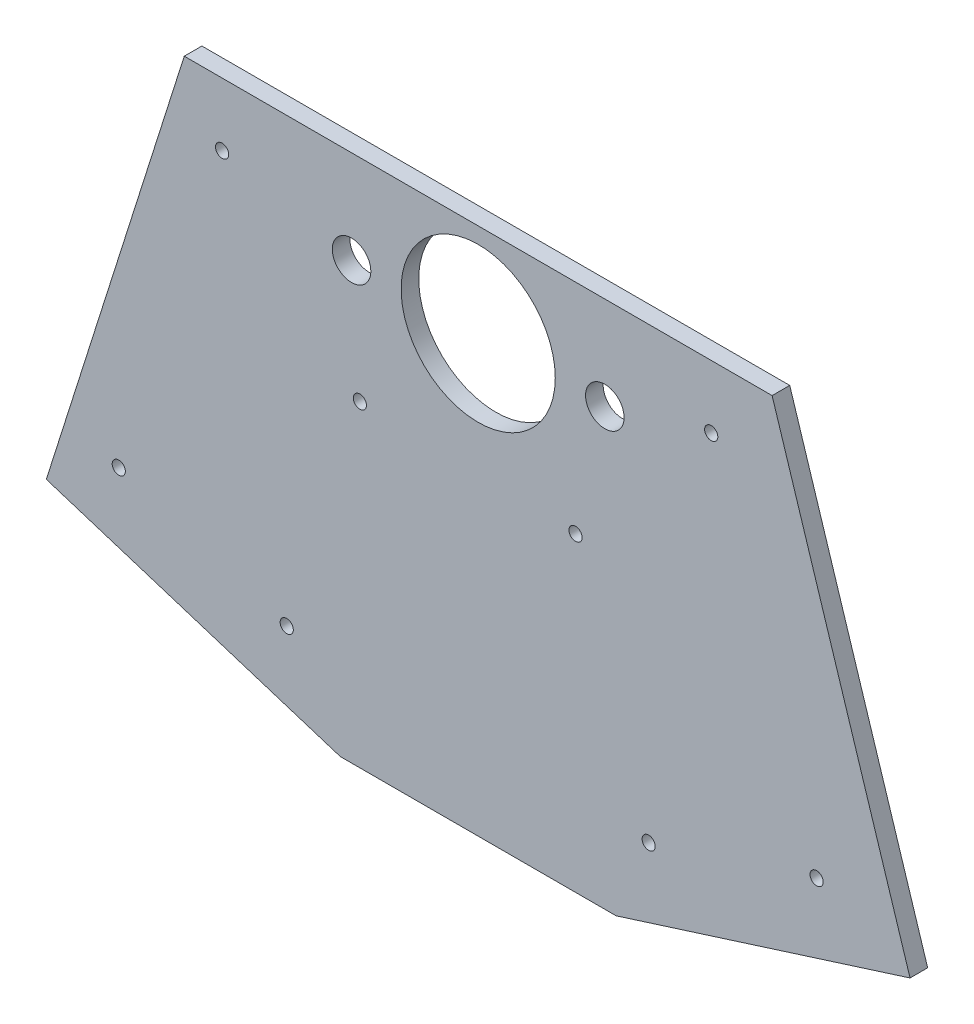
ISO-10303-21;
HEADER;
FILE_DESCRIPTION(('STEP AP214'),'2;1');
FILE_NAME('part.step','',(''),(''),'','','');
FILE_SCHEMA(('AUTOMOTIVE_DESIGN { 1 0 10303 214 1 1 1 1 }'));
ENDSEC;
DATA;
#1=APPLICATION_CONTEXT('core data for automotive mechanical design processes');
#2=APPLICATION_PROTOCOL_DEFINITION('international standard','automotive_design',2000,#1);
#3=PRODUCT_CONTEXT('',#1,'mechanical');
#4=PRODUCT('Part','Part','',(#3));
#5=PRODUCT_RELATED_PRODUCT_CATEGORY('part','',(#4));
#6=PRODUCT_DEFINITION_FORMATION('','',#4);
#7=PRODUCT_DEFINITION_CONTEXT('part definition',#1,'design');
#8=PRODUCT_DEFINITION('design','',#6,#7);
#9=PRODUCT_DEFINITION_SHAPE('','',#8);
#10=(LENGTH_UNIT() NAMED_UNIT(*) SI_UNIT(.MILLI.,.METRE.));
#11=(NAMED_UNIT(*) PLANE_ANGLE_UNIT() SI_UNIT($,.RADIAN.));
#12=(NAMED_UNIT(*) SI_UNIT($,.STERADIAN.) SOLID_ANGLE_UNIT());
#13=UNCERTAINTY_MEASURE_WITH_UNIT(LENGTH_MEASURE(1.E-05),#10,'distance_accuracy_value','');
#14=(GEOMETRIC_REPRESENTATION_CONTEXT(3) GLOBAL_UNCERTAINTY_ASSIGNED_CONTEXT((#13)) GLOBAL_UNIT_ASSIGNED_CONTEXT((#10,
#11,#12)) REPRESENTATION_CONTEXT('',''));
#15=CARTESIAN_POINT('',(0.,0.,0.));
#16=DIRECTION('',(0.,0.,1.));
#17=DIRECTION('',(1.,0.,0.));
#18=AXIS2_PLACEMENT_3D('',#15,#16,#17);
#19=CARTESIAN_POINT('',(-124.522960456792,-98.7044078807839,5.08));
#20=DIRECTION('',(0.953307939110766,-0.301999955676131,0.));
#21=DIRECTION('',(0.301999955676131,0.953307939110766,0.));
#22=AXIS2_PLACEMENT_3D('',#19,#20,#21);
#23=PLANE('',#22);
#24=DIRECTION('',(-0.301999955676131,-0.953307939110765,0.));
#25=VECTOR('',#24,1.);
#26=CARTESIAN_POINT('',(-124.522960456792,-98.7044078807839,0.));
#27=LINE('',#26,#25);
#28=CARTESIAN_POINT('',(-84.749075786947,26.8477960596081,0.));
#29=VERTEX_POINT('',#28);
#30=CARTESIAN_POINT('',(-124.522960456792,-98.7044078807839,0.));
#31=VERTEX_POINT('',#30);
#32=EDGE_CURVE('E117',#29,#31,#27,.T.);
#33=ORIENTED_EDGE('',*,*,#32,.T.);
#34=DIRECTION('',(0.,0.,-1.));
#35=VECTOR('',#34,1.);
#36=CARTESIAN_POINT('',(-124.522960456792,-98.7044078807839,5.08));
#37=LINE('',#36,#35);
#38=CARTESIAN_POINT('',(-124.522960456792,-98.7044078807839,5.08));
#39=VERTEX_POINT('',#38);
#40=EDGE_CURVE('E11',#39,#31,#37,.T.);
#41=ORIENTED_EDGE('',*,*,#40,.F.);
#42=DIRECTION('',(-0.301999955676131,-0.953307939110765,0.));
#43=VECTOR('',#42,1.);
#44=CARTESIAN_POINT('',(-124.522960456792,-98.7044078807839,5.08));
#45=LINE('',#44,#43);
#46=CARTESIAN_POINT('',(-84.749075786947,26.8477960596081,5.08));
#47=VERTEX_POINT('',#46);
#48=EDGE_CURVE('E128',#47,#39,#45,.T.);
#49=ORIENTED_EDGE('',*,*,#48,.F.);
#50=DIRECTION('',(0.,0.,-1.));
#51=VECTOR('',#50,1.);
#52=CARTESIAN_POINT('',(-84.749075786947,26.8477960596081,5.08));
#53=LINE('',#52,#51);
#54=EDGE_CURVE('E113',#47,#29,#53,.T.);
#55=ORIENTED_EDGE('',*,*,#54,.T.);
#56=EDGE_LOOP('',(#33,#41,#49,#55));
#57=FACE_BOUND('',#56,.T.);
#58=ADVANCED_FACE('F33',(#57),#23,.F.);
#59=CARTESIAN_POINT('',(-39.7738846698448,-125.552203940392,5.08));
#60=DIRECTION('',(0.301999955676131,0.953307939110766,0.));
#61=DIRECTION('',(-0.953307939110766,0.301999955676131,0.));
#62=AXIS2_PLACEMENT_3D('',#59,#60,#61);
#63=PLANE('',#62);
#64=DIRECTION('',(0.953307939110765,-0.301999955676131,0.));
#65=VECTOR('',#64,1.);
#66=CARTESIAN_POINT('',(-39.7738846698448,-125.552203940392,0.));
#67=LINE('',#66,#65);
#68=CARTESIAN_POINT('',(-39.7738846698448,-125.552203940392,0.));
#69=VERTEX_POINT('',#68);
#70=EDGE_CURVE('E120',#31,#69,#67,.T.);
#71=ORIENTED_EDGE('',*,*,#70,.T.);
#72=DIRECTION('',(0.,0.,-1.));
#73=VECTOR('',#72,1.);
#74=CARTESIAN_POINT('',(-39.7738846698448,-125.552203940392,5.08));
#75=LINE('',#74,#73);
#76=CARTESIAN_POINT('',(-39.7738846698448,-125.552203940392,5.08));
#77=VERTEX_POINT('',#76);
#78=EDGE_CURVE('E41',#77,#69,#75,.T.);
#79=ORIENTED_EDGE('',*,*,#78,.F.);
#80=DIRECTION('',(0.953307939110765,-0.301999955676131,0.));
#81=VECTOR('',#80,1.);
#82=CARTESIAN_POINT('',(-39.7738846698448,-125.552203940392,5.08));
#83=LINE('',#82,#81);
#84=EDGE_CURVE('E86',#39,#77,#83,.T.);
#85=ORIENTED_EDGE('',*,*,#84,.F.);
#86=ORIENTED_EDGE('',*,*,#40,.T.);
#87=EDGE_LOOP('',(#71,#79,#85,#86));
#88=FACE_BOUND('',#87,.T.);
#89=ADVANCED_FACE('F154',(#88),#63,.F.);
#90=CARTESIAN_POINT('',(39.7738846698448,-125.552203940392,5.08));
#91=DIRECTION('',(0.,1.,0.));
#92=DIRECTION('',(-1.,0.,0.));
#93=AXIS2_PLACEMENT_3D('',#90,#91,#92);
#94=PLANE('',#93);
#95=DIRECTION('',(1.,0.,0.));
#96=VECTOR('',#95,1.);
#97=CARTESIAN_POINT('',(39.7738846698448,-125.552203940392,0.));
#98=LINE('',#97,#96);
#99=CARTESIAN_POINT('',(39.7738846698448,-125.552203940392,0.));
#100=VERTEX_POINT('',#99);
#101=EDGE_CURVE('E123',#69,#100,#98,.T.);
#102=ORIENTED_EDGE('',*,*,#101,.T.);
#103=DIRECTION('',(0.,0.,-1.));
#104=VECTOR('',#103,1.);
#105=CARTESIAN_POINT('',(39.7738846698448,-125.552203940392,5.08));
#106=LINE('',#105,#104);
#107=CARTESIAN_POINT('',(39.7738846698448,-125.552203940392,5.08));
#108=VERTEX_POINT('',#107);
#109=EDGE_CURVE('E108',#108,#100,#106,.T.);
#110=ORIENTED_EDGE('',*,*,#109,.F.);
#111=DIRECTION('',(1.,0.,0.));
#112=VECTOR('',#111,1.);
#113=CARTESIAN_POINT('',(39.7738846698448,-125.552203940392,5.08));
#114=LINE('',#113,#112);
#115=EDGE_CURVE('E99',#77,#108,#114,.T.);
#116=ORIENTED_EDGE('',*,*,#115,.F.);
#117=ORIENTED_EDGE('',*,*,#78,.T.);
#118=EDGE_LOOP('',(#102,#110,#116,#117));
#119=FACE_BOUND('',#118,.T.);
#120=ADVANCED_FACE('F134',(#119),#94,.F.);
#121=CARTESIAN_POINT('',(124.522960456792,-98.7044078807839,5.08));
#122=DIRECTION('',(-0.301999955676131,0.953307939110766,0.));
#123=DIRECTION('',(-0.953307939110765,-0.301999955676131,0.));
#124=AXIS2_PLACEMENT_3D('',#121,#122,#123);
#125=PLANE('',#124);
#126=DIRECTION('',(0.953307939110765,0.301999955676131,0.));
#127=VECTOR('',#126,1.);
#128=CARTESIAN_POINT('',(124.522960456792,-98.7044078807839,0.));
#129=LINE('',#128,#127);
#130=CARTESIAN_POINT('',(124.522960456792,-98.7044078807839,0.));
#131=VERTEX_POINT('',#130);
#132=EDGE_CURVE('E107',#100,#131,#129,.T.);
#133=ORIENTED_EDGE('',*,*,#132,.T.);
#134=DIRECTION('',(0.,0.,-1.));
#135=VECTOR('',#134,1.);
#136=CARTESIAN_POINT('',(124.522960456792,-98.7044078807839,5.08));
#137=LINE('',#136,#135);
#138=CARTESIAN_POINT('',(124.522960456792,-98.7044078807839,5.08));
#139=VERTEX_POINT('',#138);
#140=EDGE_CURVE('E104',#139,#131,#137,.T.);
#141=ORIENTED_EDGE('',*,*,#140,.F.);
#142=DIRECTION('',(0.953307939110765,0.301999955676131,0.));
#143=VECTOR('',#142,1.);
#144=CARTESIAN_POINT('',(124.522960456792,-98.7044078807839,5.08));
#145=LINE('',#144,#143);
#146=EDGE_CURVE('E93',#108,#139,#145,.T.);
#147=ORIENTED_EDGE('',*,*,#146,.F.);
#148=ORIENTED_EDGE('',*,*,#109,.T.);
#149=EDGE_LOOP('',(#133,#141,#147,#148));
#150=FACE_BOUND('',#149,.T.);
#151=ADVANCED_FACE('F105',(#150),#125,.F.);
#152=CARTESIAN_POINT('',(84.749075786947,26.8477960596081,5.08));
#153=DIRECTION('',(-0.953307939110765,-0.301999955676132,0.));
#154=DIRECTION('',(0.301999955676132,-0.953307939110765,0.));
#155=AXIS2_PLACEMENT_3D('',#152,#153,#154);
#156=PLANE('',#155);
#157=DIRECTION('',(-0.301999955676132,0.953307939110765,0.));
#158=VECTOR('',#157,1.);
#159=CARTESIAN_POINT('',(84.749075786947,26.8477960596081,0.));
#160=LINE('',#159,#158);
#161=CARTESIAN_POINT('',(84.749075786947,26.8477960596081,0.));
#162=VERTEX_POINT('',#161);
#163=EDGE_CURVE('E72',#131,#162,#160,.T.);
#164=ORIENTED_EDGE('',*,*,#163,.T.);
#165=DIRECTION('',(0.,0.,-1.));
#166=VECTOR('',#165,1.);
#167=CARTESIAN_POINT('',(84.749075786947,26.8477960596081,5.08));
#168=LINE('',#167,#166);
#169=CARTESIAN_POINT('',(84.749075786947,26.8477960596081,5.08));
#170=VERTEX_POINT('',#169);
#171=EDGE_CURVE('E109',#170,#162,#168,.T.);
#172=ORIENTED_EDGE('',*,*,#171,.F.);
#173=DIRECTION('',(-0.301999955676132,0.953307939110765,0.));
#174=VECTOR('',#173,1.);
#175=CARTESIAN_POINT('',(84.749075786947,26.8477960596081,5.08));
#176=LINE('',#175,#174);
#177=EDGE_CURVE('E97',#139,#170,#176,.T.);
#178=ORIENTED_EDGE('',*,*,#177,.F.);
#179=ORIENTED_EDGE('',*,*,#140,.T.);
#180=EDGE_LOOP('',(#164,#172,#178,#179));
#181=FACE_BOUND('',#180,.T.);
#182=ADVANCED_FACE('F111',(#181),#156,.F.);
#183=CARTESIAN_POINT('',(-84.749075786947,26.8477960596081,5.08));
#184=DIRECTION('',(0.,-1.,0.));
#185=DIRECTION('',(0.,0.,-1.));
#186=AXIS2_PLACEMENT_3D('',#183,#184,#185);
#187=PLANE('',#186);
#188=DIRECTION('',(-1.,0.,0.));
#189=VECTOR('',#188,1.);
#190=CARTESIAN_POINT('',(-84.749075786947,26.8477960596081,0.));
#191=LINE('',#190,#189);
#192=EDGE_CURVE('E78',#162,#29,#191,.T.);
#193=ORIENTED_EDGE('',*,*,#192,.T.);
#194=ORIENTED_EDGE('',*,*,#54,.F.);
#195=DIRECTION('',(-1.,0.,0.));
#196=VECTOR('',#195,1.);
#197=CARTESIAN_POINT('',(-84.749075786947,26.8477960596081,5.08));
#198=LINE('',#197,#196);
#199=EDGE_CURVE('E49',#170,#47,#198,.T.);
#200=ORIENTED_EDGE('',*,*,#199,.F.);
#201=ORIENTED_EDGE('',*,*,#171,.T.);
#202=EDGE_LOOP('',(#193,#194,#200,#201));
#203=FACE_BOUND('',#202,.T.);
#204=ADVANCED_FACE('F141',(#203),#187,.F.);
#205=CARTESIAN_POINT('',(0.,0.,5.08));
#206=DIRECTION('',(0.,0.,1.));
#207=DIRECTION('',(1.,0.,0.));
#208=AXIS2_PLACEMENT_3D('',#205,#206,#207);
#209=PLANE('',#208);
#210=CARTESIAN_POINT('',(-73.8496334617962,8.687279819548,5.08));
#211=DIRECTION('',(0.,0.,1.));
#212=DIRECTION('',(1.,0.,0.));
#213=AXIS2_PLACEMENT_3D('',#210,#211,#212);
#214=CIRCLE('',#213,1.89864999999999);
#215=CARTESIAN_POINT('',(-71.9509834617962,8.687279819548,5.08));
#216=VERTEX_POINT('',#215);
#217=EDGE_CURVE('E305',#216,#216,#214,.T.);
#218=ORIENTED_EDGE('',*,*,#217,.F.);
#219=EDGE_LOOP('',(#218));
#220=FACE_BOUND('',#219,.T.);
#221=CARTESIAN_POINT('',(-103.636097767778,-85.3381409370824,5.08));
#222=DIRECTION('',(0.,0.,1.));
#223=DIRECTION('',(1.,0.,0.));
#224=AXIS2_PLACEMENT_3D('',#221,#222,#223);
#225=CIRCLE('',#224,1.89864999999999);
#226=CARTESIAN_POINT('',(-101.737447767778,-85.3381409370824,5.08));
#227=VERTEX_POINT('',#226);
#228=EDGE_CURVE('E307',#227,#227,#225,.T.);
#229=ORIENTED_EDGE('',*,*,#228,.F.);
#230=EDGE_LOOP('',(#229));
#231=FACE_BOUND('',#230,.T.);
#232=CARTESIAN_POINT('',(-55.2080544609512,-100.67973868543,5.08));
#233=DIRECTION('',(0.,0.,1.));
#234=DIRECTION('',(1.,0.,0.));
#235=AXIS2_PLACEMENT_3D('',#232,#233,#234);
#236=CIRCLE('',#235,1.89864999999999);
#237=CARTESIAN_POINT('',(-53.3094044609512,-100.67973868543,5.08));
#238=VERTEX_POINT('',#237);
#239=EDGE_CURVE('E315',#238,#238,#236,.T.);
#240=ORIENTED_EDGE('',*,*,#239,.F.);
#241=EDGE_LOOP('',(#240));
#242=FACE_BOUND('',#241,.T.);
#243=CARTESIAN_POINT('',(-34.1133575569735,-34.0911791385429,5.08));
#244=DIRECTION('',(0.,0.,1.));
#245=DIRECTION('',(1.,0.,0.));
#246=AXIS2_PLACEMENT_3D('',#243,#244,#245);
#247=CIRCLE('',#246,1.89864999999999);
#248=CARTESIAN_POINT('',(-32.2147075569735,-34.0911791385429,5.08));
#249=VERTEX_POINT('',#248);
#250=EDGE_CURVE('E321',#249,#249,#247,.T.);
#251=ORIENTED_EDGE('',*,*,#250,.F.);
#252=EDGE_LOOP('',(#251));
#253=FACE_BOUND('',#252,.T.);
#254=CARTESIAN_POINT('',(49.1545490475979,-102.597438403973,5.08));
#255=DIRECTION('',(0.,0.,1.));
#256=DIRECTION('',(1.,0.,0.));
#257=AXIS2_PLACEMENT_3D('',#254,#255,#256);
#258=CIRCLE('',#257,1.89864999999999);
#259=CARTESIAN_POINT('',(51.0531990475979,-102.597438403973,5.08));
#260=VERTEX_POINT('',#259);
#261=EDGE_CURVE('E327',#260,#260,#258,.T.);
#262=ORIENTED_EDGE('',*,*,#261,.F.);
#263=EDGE_LOOP('',(#262));
#264=FACE_BOUND('',#263,.T.);
#265=CARTESIAN_POINT('',(97.5825923544247,-87.2558406556258,5.08));
#266=DIRECTION('',(0.,0.,1.));
#267=DIRECTION('',(1.,0.,0.));
#268=AXIS2_PLACEMENT_3D('',#265,#266,#267);
#269=CIRCLE('',#268,1.89864999999999);
#270=CARTESIAN_POINT('',(99.4812423544247,-87.2558406556258,5.08));
#271=VERTEX_POINT('',#270);
#272=EDGE_CURVE('E333',#271,#271,#269,.T.);
#273=ORIENTED_EDGE('',*,*,#272,.F.);
#274=EDGE_LOOP('',(#273));
#275=FACE_BOUND('',#274,.T.);
#276=CARTESIAN_POINT('',(28.0598521436201,-36.0088788570863,5.08));
#277=DIRECTION('',(0.,0.,1.));
#278=DIRECTION('',(1.,0.,0.));
#279=AXIS2_PLACEMENT_3D('',#276,#277,#278);
#280=CIRCLE('',#279,1.89864999999999);
#281=CARTESIAN_POINT('',(29.9585021436201,-36.0088788570863,5.08));
#282=VERTEX_POINT('',#281);
#283=EDGE_CURVE('E339',#282,#282,#280,.T.);
#284=ORIENTED_EDGE('',*,*,#283,.F.);
#285=EDGE_LOOP('',(#284));
#286=FACE_BOUND('',#285,.T.);
#287=CARTESIAN_POINT('',(67.1886168694837,8.687279819548,5.08));
#288=DIRECTION('',(0.,0.,1.));
#289=DIRECTION('',(1.,0.,0.));
#290=AXIS2_PLACEMENT_3D('',#287,#288,#289);
#291=CIRCLE('',#290,1.89864999999999);
#292=CARTESIAN_POINT('',(69.0872668694837,8.687279819548,5.08));
#293=VERTEX_POINT('',#292);
#294=EDGE_CURVE('E345',#293,#293,#291,.T.);
#295=ORIENTED_EDGE('',*,*,#294,.F.);
#296=EDGE_LOOP('',(#295));
#297=FACE_BOUND('',#296,.T.);
#298=CARTESIAN_POINT('',(36.5125,0.,5.08));
#299=DIRECTION('',(0.,0.,1.));
#300=DIRECTION('',(1.,0.,0.));
#301=AXIS2_PLACEMENT_3D('',#298,#299,#300);
#302=CIRCLE('',#301,5.55625);
#303=CARTESIAN_POINT('',(42.06875,0.,5.08));
#304=VERTEX_POINT('',#303);
#305=EDGE_CURVE('E351',#304,#304,#302,.T.);
#306=ORIENTED_EDGE('',*,*,#305,.F.);
#307=EDGE_LOOP('',(#306));
#308=FACE_BOUND('',#307,.T.);
#309=CARTESIAN_POINT('',(-36.5125,0.,5.08));
#310=DIRECTION('',(0.,0.,1.));
#311=DIRECTION('',(1.,0.,0.));
#312=AXIS2_PLACEMENT_3D('',#309,#310,#311);
#313=CIRCLE('',#312,5.55625);
#314=CARTESIAN_POINT('',(-30.95625,0.,5.08));
#315=VERTEX_POINT('',#314);
#316=EDGE_CURVE('E356',#315,#315,#313,.T.);
#317=ORIENTED_EDGE('',*,*,#316,.F.);
#318=EDGE_LOOP('',(#317));
#319=FACE_BOUND('',#318,.T.);
#320=CARTESIAN_POINT('',(0.,0.,5.08));
#321=DIRECTION('',(0.,0.,1.));
#322=DIRECTION('',(1.,0.,0.));
#323=AXIS2_PLACEMENT_3D('',#320,#321,#322);
#324=CIRCLE('',#323,22.225);
#325=CARTESIAN_POINT('',(22.225,0.,5.08));
#326=VERTEX_POINT('',#325);
#327=EDGE_CURVE('E355',#326,#326,#324,.T.);
#328=ORIENTED_EDGE('',*,*,#327,.F.);
#329=EDGE_LOOP('',(#328));
#330=FACE_BOUND('',#329,.T.);
#331=ORIENTED_EDGE('',*,*,#48,.T.);
#332=ORIENTED_EDGE('',*,*,#84,.T.);
#333=ORIENTED_EDGE('',*,*,#115,.T.);
#334=ORIENTED_EDGE('',*,*,#146,.T.);
#335=ORIENTED_EDGE('',*,*,#177,.T.);
#336=ORIENTED_EDGE('',*,*,#199,.T.);
#337=EDGE_LOOP('',(#331,#332,#333,#334,#335,#336));
#338=FACE_BOUND('',#337,.T.);
#339=ADVANCED_FACE('F95',(#220,#231,#242,#253,#264,#275,#286,#297,#308,#319,#330,#338),#209,.T.);
#340=CARTESIAN_POINT('',(0.,0.,0.));
#341=DIRECTION('',(0.,0.,1.));
#342=DIRECTION('',(1.,0.,0.));
#343=AXIS2_PLACEMENT_3D('',#340,#341,#342);
#344=PLANE('',#343);
#345=CARTESIAN_POINT('',(-73.8496334617962,8.687279819548,0.));
#346=DIRECTION('',(0.,0.,1.));
#347=DIRECTION('',(1.,0.,0.));
#348=AXIS2_PLACEMENT_3D('',#345,#346,#347);
#349=CIRCLE('',#348,1.89865);
#350=CARTESIAN_POINT('',(-71.9509834617962,8.687279819548,0.));
#351=VERTEX_POINT('',#350);
#352=EDGE_CURVE('E302',#351,#351,#349,.T.);
#353=ORIENTED_EDGE('',*,*,#352,.T.);
#354=EDGE_LOOP('',(#353));
#355=FACE_BOUND('',#354,.T.);
#356=CARTESIAN_POINT('',(-103.636097767778,-85.3381409370824,0.));
#357=DIRECTION('',(0.,0.,1.));
#358=DIRECTION('',(1.,0.,0.));
#359=AXIS2_PLACEMENT_3D('',#356,#357,#358);
#360=CIRCLE('',#359,1.89865);
#361=CARTESIAN_POINT('',(-101.737447767778,-85.3381409370824,0.));
#362=VERTEX_POINT('',#361);
#363=EDGE_CURVE('E312',#362,#362,#360,.T.);
#364=ORIENTED_EDGE('',*,*,#363,.T.);
#365=EDGE_LOOP('',(#364));
#366=FACE_BOUND('',#365,.T.);
#367=CARTESIAN_POINT('',(-55.2080544609512,-100.67973868543,0.));
#368=DIRECTION('',(0.,0.,1.));
#369=DIRECTION('',(1.,0.,0.));
#370=AXIS2_PLACEMENT_3D('',#367,#368,#369);
#371=CIRCLE('',#370,1.89864999999999);
#372=CARTESIAN_POINT('',(-53.3094044609512,-100.67973868543,0.));
#373=VERTEX_POINT('',#372);
#374=EDGE_CURVE('E318',#373,#373,#371,.T.);
#375=ORIENTED_EDGE('',*,*,#374,.T.);
#376=EDGE_LOOP('',(#375));
#377=FACE_BOUND('',#376,.T.);
#378=CARTESIAN_POINT('',(-34.1133575569735,-34.0911791385429,0.));
#379=DIRECTION('',(0.,0.,1.));
#380=DIRECTION('',(1.,0.,0.));
#381=AXIS2_PLACEMENT_3D('',#378,#379,#380);
#382=CIRCLE('',#381,1.89864999999999);
#383=CARTESIAN_POINT('',(-32.2147075569735,-34.0911791385429,0.));
#384=VERTEX_POINT('',#383);
#385=EDGE_CURVE('E324',#384,#384,#382,.T.);
#386=ORIENTED_EDGE('',*,*,#385,.T.);
#387=EDGE_LOOP('',(#386));
#388=FACE_BOUND('',#387,.T.);
#389=CARTESIAN_POINT('',(49.1545490475979,-102.597438403973,0.));
#390=DIRECTION('',(0.,0.,1.));
#391=DIRECTION('',(1.,0.,0.));
#392=AXIS2_PLACEMENT_3D('',#389,#390,#391);
#393=CIRCLE('',#392,1.89864999999999);
#394=CARTESIAN_POINT('',(51.0531990475979,-102.597438403973,0.));
#395=VERTEX_POINT('',#394);
#396=EDGE_CURVE('E330',#395,#395,#393,.T.);
#397=ORIENTED_EDGE('',*,*,#396,.T.);
#398=EDGE_LOOP('',(#397));
#399=FACE_BOUND('',#398,.T.);
#400=CARTESIAN_POINT('',(97.5825923544247,-87.2558406556258,0.));
#401=DIRECTION('',(0.,0.,1.));
#402=DIRECTION('',(1.,0.,0.));
#403=AXIS2_PLACEMENT_3D('',#400,#401,#402);
#404=CIRCLE('',#403,1.89865);
#405=CARTESIAN_POINT('',(99.4812423544247,-87.2558406556258,0.));
#406=VERTEX_POINT('',#405);
#407=EDGE_CURVE('E336',#406,#406,#404,.T.);
#408=ORIENTED_EDGE('',*,*,#407,.T.);
#409=EDGE_LOOP('',(#408));
#410=FACE_BOUND('',#409,.T.);
#411=CARTESIAN_POINT('',(28.0598521436201,-36.0088788570863,0.));
#412=DIRECTION('',(0.,0.,1.));
#413=DIRECTION('',(1.,0.,0.));
#414=AXIS2_PLACEMENT_3D('',#411,#412,#413);
#415=CIRCLE('',#414,1.89865);
#416=CARTESIAN_POINT('',(29.9585021436201,-36.0088788570863,0.));
#417=VERTEX_POINT('',#416);
#418=EDGE_CURVE('E342',#417,#417,#415,.T.);
#419=ORIENTED_EDGE('',*,*,#418,.T.);
#420=EDGE_LOOP('',(#419));
#421=FACE_BOUND('',#420,.T.);
#422=CARTESIAN_POINT('',(67.1886168694837,8.687279819548,0.));
#423=DIRECTION('',(0.,0.,1.));
#424=DIRECTION('',(1.,0.,0.));
#425=AXIS2_PLACEMENT_3D('',#422,#423,#424);
#426=CIRCLE('',#425,1.89865);
#427=CARTESIAN_POINT('',(69.0872668694837,8.687279819548,0.));
#428=VERTEX_POINT('',#427);
#429=EDGE_CURVE('E348',#428,#428,#426,.T.);
#430=ORIENTED_EDGE('',*,*,#429,.T.);
#431=EDGE_LOOP('',(#430));
#432=FACE_BOUND('',#431,.T.);
#433=CARTESIAN_POINT('',(36.5125,0.,0.));
#434=DIRECTION('',(0.,0.,1.));
#435=DIRECTION('',(1.,0.,0.));
#436=AXIS2_PLACEMENT_3D('',#433,#434,#435);
#437=CIRCLE('',#436,5.55625);
#438=CARTESIAN_POINT('',(42.06875,0.,0.));
#439=VERTEX_POINT('',#438);
#440=EDGE_CURVE('E359',#439,#439,#437,.T.);
#441=ORIENTED_EDGE('',*,*,#440,.T.);
#442=EDGE_LOOP('',(#441));
#443=FACE_BOUND('',#442,.T.);
#444=CARTESIAN_POINT('',(-36.5125,0.,0.));
#445=DIRECTION('',(0.,0.,1.));
#446=DIRECTION('',(1.,0.,0.));
#447=AXIS2_PLACEMENT_3D('',#444,#445,#446);
#448=CIRCLE('',#447,5.55625);
#449=CARTESIAN_POINT('',(-30.95625,0.,0.));
#450=VERTEX_POINT('',#449);
#451=EDGE_CURVE('E352',#450,#450,#448,.T.);
#452=ORIENTED_EDGE('',*,*,#451,.T.);
#453=EDGE_LOOP('',(#452));
#454=FACE_BOUND('',#453,.T.);
#455=CARTESIAN_POINT('',(0.,0.,0.));
#456=DIRECTION('',(0.,0.,1.));
#457=DIRECTION('',(1.,0.,0.));
#458=AXIS2_PLACEMENT_3D('',#455,#456,#457);
#459=CIRCLE('',#458,22.225);
#460=CARTESIAN_POINT('',(22.225,0.,0.));
#461=VERTEX_POINT('',#460);
#462=EDGE_CURVE('E121',#461,#461,#459,.T.);
#463=ORIENTED_EDGE('',*,*,#462,.T.);
#464=EDGE_LOOP('',(#463));
#465=FACE_BOUND('',#464,.T.);
#466=ORIENTED_EDGE('',*,*,#32,.F.);
#467=ORIENTED_EDGE('',*,*,#192,.F.);
#468=ORIENTED_EDGE('',*,*,#163,.F.);
#469=ORIENTED_EDGE('',*,*,#132,.F.);
#470=ORIENTED_EDGE('',*,*,#101,.F.);
#471=ORIENTED_EDGE('',*,*,#70,.F.);
#472=EDGE_LOOP('',(#466,#467,#468,#469,#470,#471));
#473=FACE_BOUND('',#472,.T.);
#474=ADVANCED_FACE('F137',(#355,#366,#377,#388,#399,#410,#421,#432,#443,#454,#465,#473),#344,.F.);
#475=CARTESIAN_POINT('',(0.,0.,0.));
#476=DIRECTION('',(0.,0.,1.));
#477=DIRECTION('',(1.,0.,0.));
#478=AXIS2_PLACEMENT_3D('',#475,#476,#477);
#479=CYLINDRICAL_SURFACE('',#478,22.225);
#480=ORIENTED_EDGE('',*,*,#462,.F.);
#481=EDGE_LOOP('',(#480));
#482=FACE_BOUND('',#481,.T.);
#483=ORIENTED_EDGE('',*,*,#327,.T.);
#484=EDGE_LOOP('',(#483));
#485=FACE_BOUND('',#484,.T.);
#486=ADVANCED_FACE('F182',(#482,#485),#479,.F.);
#487=CARTESIAN_POINT('',(-36.5125,0.,0.));
#488=DIRECTION('',(0.,0.,1.));
#489=DIRECTION('',(1.,0.,0.));
#490=AXIS2_PLACEMENT_3D('',#487,#488,#489);
#491=CYLINDRICAL_SURFACE('',#490,5.55625);
#492=ORIENTED_EDGE('',*,*,#451,.F.);
#493=EDGE_LOOP('',(#492));
#494=FACE_BOUND('',#493,.T.);
#495=ORIENTED_EDGE('',*,*,#316,.T.);
#496=EDGE_LOOP('',(#495));
#497=FACE_BOUND('',#496,.T.);
#498=ADVANCED_FACE('F187',(#494,#497),#491,.F.);
#499=CARTESIAN_POINT('',(36.5125,0.,0.));
#500=DIRECTION('',(0.,0.,1.));
#501=DIRECTION('',(1.,0.,0.));
#502=AXIS2_PLACEMENT_3D('',#499,#500,#501);
#503=CYLINDRICAL_SURFACE('',#502,5.55625);
#504=ORIENTED_EDGE('',*,*,#440,.F.);
#505=EDGE_LOOP('',(#504));
#506=FACE_BOUND('',#505,.T.);
#507=ORIENTED_EDGE('',*,*,#305,.T.);
#508=EDGE_LOOP('',(#507));
#509=FACE_BOUND('',#508,.T.);
#510=ADVANCED_FACE('F199',(#506,#509),#503,.F.);
#511=CARTESIAN_POINT('',(67.1886168694837,8.687279819548,5.08));
#512=DIRECTION('',(0.,0.,1.));
#513=DIRECTION('',(1.,0.,0.));
#514=AXIS2_PLACEMENT_3D('',#511,#512,#513);
#515=CYLINDRICAL_SURFACE('',#514,1.89864999999999);
#516=ORIENTED_EDGE('',*,*,#429,.F.);
#517=EDGE_LOOP('',(#516));
#518=FACE_BOUND('',#517,.T.);
#519=ORIENTED_EDGE('',*,*,#294,.T.);
#520=EDGE_LOOP('',(#519));
#521=FACE_BOUND('',#520,.T.);
#522=ADVANCED_FACE('F208',(#518,#521),#515,.F.);
#523=CARTESIAN_POINT('',(28.0598521436201,-36.0088788570863,5.08));
#524=DIRECTION('',(0.,0.,1.));
#525=DIRECTION('',(1.,0.,0.));
#526=AXIS2_PLACEMENT_3D('',#523,#524,#525);
#527=CYLINDRICAL_SURFACE('',#526,1.89864999999999);
#528=ORIENTED_EDGE('',*,*,#418,.F.);
#529=EDGE_LOOP('',(#528));
#530=FACE_BOUND('',#529,.T.);
#531=ORIENTED_EDGE('',*,*,#283,.T.);
#532=EDGE_LOOP('',(#531));
#533=FACE_BOUND('',#532,.T.);
#534=ADVANCED_FACE('F225',(#530,#533),#527,.F.);
#535=CARTESIAN_POINT('',(97.5825923544247,-87.2558406556258,5.08));
#536=DIRECTION('',(0.,0.,1.));
#537=DIRECTION('',(1.,0.,0.));
#538=AXIS2_PLACEMENT_3D('',#535,#536,#537);
#539=CYLINDRICAL_SURFACE('',#538,1.89864999999999);
#540=ORIENTED_EDGE('',*,*,#407,.F.);
#541=EDGE_LOOP('',(#540));
#542=FACE_BOUND('',#541,.T.);
#543=ORIENTED_EDGE('',*,*,#272,.T.);
#544=EDGE_LOOP('',(#543));
#545=FACE_BOUND('',#544,.T.);
#546=ADVANCED_FACE('F235',(#542,#545),#539,.F.);
#547=CARTESIAN_POINT('',(49.1545490475979,-102.597438403973,5.08));
#548=DIRECTION('',(0.,0.,1.));
#549=DIRECTION('',(1.,0.,0.));
#550=AXIS2_PLACEMENT_3D('',#547,#548,#549);
#551=CYLINDRICAL_SURFACE('',#550,1.89864999999999);
#552=ORIENTED_EDGE('',*,*,#396,.F.);
#553=EDGE_LOOP('',(#552));
#554=FACE_BOUND('',#553,.T.);
#555=ORIENTED_EDGE('',*,*,#261,.T.);
#556=EDGE_LOOP('',(#555));
#557=FACE_BOUND('',#556,.T.);
#558=ADVANCED_FACE('F245',(#554,#557),#551,.F.);
#559=CARTESIAN_POINT('',(-34.1133575569735,-34.0911791385429,5.08));
#560=DIRECTION('',(0.,0.,1.));
#561=DIRECTION('',(1.,0.,0.));
#562=AXIS2_PLACEMENT_3D('',#559,#560,#561);
#563=CYLINDRICAL_SURFACE('',#562,1.89864999999999);
#564=ORIENTED_EDGE('',*,*,#385,.F.);
#565=EDGE_LOOP('',(#564));
#566=FACE_BOUND('',#565,.T.);
#567=ORIENTED_EDGE('',*,*,#250,.T.);
#568=EDGE_LOOP('',(#567));
#569=FACE_BOUND('',#568,.T.);
#570=ADVANCED_FACE('F255',(#566,#569),#563,.F.);
#571=CARTESIAN_POINT('',(-55.2080544609512,-100.67973868543,5.08));
#572=DIRECTION('',(0.,0.,1.));
#573=DIRECTION('',(1.,0.,0.));
#574=AXIS2_PLACEMENT_3D('',#571,#572,#573);
#575=CYLINDRICAL_SURFACE('',#574,1.89864999999999);
#576=ORIENTED_EDGE('',*,*,#374,.F.);
#577=EDGE_LOOP('',(#576));
#578=FACE_BOUND('',#577,.T.);
#579=ORIENTED_EDGE('',*,*,#239,.T.);
#580=EDGE_LOOP('',(#579));
#581=FACE_BOUND('',#580,.T.);
#582=ADVANCED_FACE('F265',(#578,#581),#575,.F.);
#583=CARTESIAN_POINT('',(-103.636097767778,-85.3381409370824,5.08));
#584=DIRECTION('',(0.,0.,1.));
#585=DIRECTION('',(1.,0.,0.));
#586=AXIS2_PLACEMENT_3D('',#583,#584,#585);
#587=CYLINDRICAL_SURFACE('',#586,1.89864999999999);
#588=ORIENTED_EDGE('',*,*,#363,.F.);
#589=EDGE_LOOP('',(#588));
#590=FACE_BOUND('',#589,.T.);
#591=ORIENTED_EDGE('',*,*,#228,.T.);
#592=EDGE_LOOP('',(#591));
#593=FACE_BOUND('',#592,.T.);
#594=ADVANCED_FACE('F275',(#590,#593),#587,.F.);
#595=CARTESIAN_POINT('',(-73.8496334617962,8.687279819548,5.08));
#596=DIRECTION('',(0.,0.,1.));
#597=DIRECTION('',(1.,0.,0.));
#598=AXIS2_PLACEMENT_3D('',#595,#596,#597);
#599=CYLINDRICAL_SURFACE('',#598,1.89864999999999);
#600=ORIENTED_EDGE('',*,*,#352,.F.);
#601=EDGE_LOOP('',(#600));
#602=FACE_BOUND('',#601,.T.);
#603=ORIENTED_EDGE('',*,*,#217,.T.);
#604=EDGE_LOOP('',(#603));
#605=FACE_BOUND('',#604,.T.);
#606=ADVANCED_FACE('F285',(#602,#605),#599,.F.);
#607=CLOSED_SHELL('',(#58,#89,#120,#151,#182,#204,#339,#474,#486,#498,#510,#522,#534,#546,#558,
#570,#582,#594,#606));
#608=MANIFOLD_SOLID_BREP('B2',#607);
#609=ADVANCED_BREP_SHAPE_REPRESENTATION('',(#18,#608),#14);
#610=SHAPE_DEFINITION_REPRESENTATION(#9,#609);
ENDSEC;
END-ISO-10303-21;
